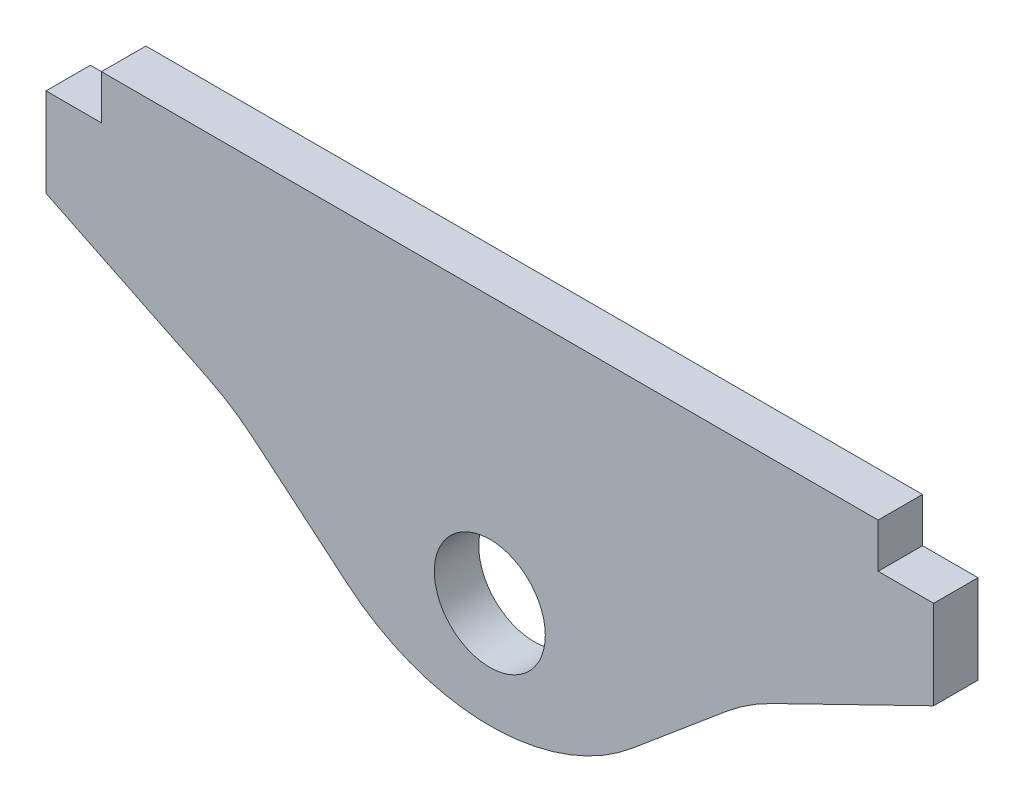
ISO-10303-21;
HEADER;
FILE_DESCRIPTION(('STEP AP214'),'2;1');
FILE_NAME('part.step','',(''),(''),'','','');
FILE_SCHEMA(('AUTOMOTIVE_DESIGN { 1 0 10303 214 1 1 1 1 }'));
ENDSEC;
DATA;
#1=APPLICATION_CONTEXT('core data for automotive mechanical design processes');
#2=APPLICATION_PROTOCOL_DEFINITION('international standard','automotive_design',2000,#1);
#3=PRODUCT_CONTEXT('',#1,'mechanical');
#4=PRODUCT('Part','Part','',(#3));
#5=PRODUCT_RELATED_PRODUCT_CATEGORY('part','',(#4));
#6=PRODUCT_DEFINITION_FORMATION('','',#4);
#7=PRODUCT_DEFINITION_CONTEXT('part definition',#1,'design');
#8=PRODUCT_DEFINITION('design','',#6,#7);
#9=PRODUCT_DEFINITION_SHAPE('','',#8);
#10=(LENGTH_UNIT() NAMED_UNIT(*) SI_UNIT(.MILLI.,.METRE.));
#11=(NAMED_UNIT(*) PLANE_ANGLE_UNIT() SI_UNIT($,.RADIAN.));
#12=(NAMED_UNIT(*) SI_UNIT($,.STERADIAN.) SOLID_ANGLE_UNIT());
#13=UNCERTAINTY_MEASURE_WITH_UNIT(LENGTH_MEASURE(1.E-05),#10,'distance_accuracy_value','');
#14=(GEOMETRIC_REPRESENTATION_CONTEXT(3) GLOBAL_UNCERTAINTY_ASSIGNED_CONTEXT((#13)) GLOBAL_UNIT_ASSIGNED_CONTEXT((#10,
#11,#12)) REPRESENTATION_CONTEXT('',''));
#15=CARTESIAN_POINT('',(0.,0.,0.));
#16=DIRECTION('',(0.,0.,1.));
#17=DIRECTION('',(1.,0.,0.));
#18=AXIS2_PLACEMENT_3D('',#15,#16,#17);
#19=CARTESIAN_POINT('',(-20.,0.,2.));
#20=DIRECTION('',(-1.,0.,0.));
#21=DIRECTION('',(0.,0.,1.));
#22=AXIS2_PLACEMENT_3D('',#19,#20,#21);
#23=PLANE('',#22);
#24=DIRECTION('',(0.,1.,0.));
#25=VECTOR('',#24,1.);
#26=CARTESIAN_POINT('',(-20.,0.,0.));
#27=LINE('',#26,#25);
#28=CARTESIAN_POINT('',(-20.,6.,0.));
#29=VERTEX_POINT('',#28);
#30=CARTESIAN_POINT('',(-20.,9.99999999999999,0.));
#31=VERTEX_POINT('',#30);
#32=EDGE_CURVE('E160',#29,#31,#27,.T.);
#33=ORIENTED_EDGE('',*,*,#32,.F.);
#34=DIRECTION('',(0.,0.,-1.));
#35=VECTOR('',#34,1.);
#36=CARTESIAN_POINT('',(-20.,6.,2.));
#37=LINE('',#36,#35);
#38=CARTESIAN_POINT('',(-20.,6.,2.));
#39=VERTEX_POINT('',#38);
#40=EDGE_CURVE('E146',#39,#29,#37,.T.);
#41=ORIENTED_EDGE('',*,*,#40,.F.);
#42=DIRECTION('',(0.,1.,0.));
#43=VECTOR('',#42,1.);
#44=CARTESIAN_POINT('',(-20.,0.,2.));
#45=LINE('',#44,#43);
#46=CARTESIAN_POINT('',(-20.,9.99999999999999,2.));
#47=VERTEX_POINT('',#46);
#48=EDGE_CURVE('E154',#39,#47,#45,.T.);
#49=ORIENTED_EDGE('',*,*,#48,.T.);
#50=DIRECTION('',(0.,0.,-1.));
#51=VECTOR('',#50,1.);
#52=CARTESIAN_POINT('',(-20.,9.99999999999999,2.));
#53=LINE('',#52,#51);
#54=EDGE_CURVE('E210',#47,#31,#53,.T.);
#55=ORIENTED_EDGE('',*,*,#54,.T.);
#56=EDGE_LOOP('',(#33,#41,#49,#55));
#57=FACE_BOUND('',#56,.T.);
#58=ADVANCED_FACE('F39',(#57),#23,.T.);
#59=CARTESIAN_POINT('',(-1.47935298592318,-3.03312311009014,2.));
#60=DIRECTION('',(-0.438371146789072,-0.89879404629917,0.));
#61=DIRECTION('',(0.89879404629917,-0.438371146789072,0.));
#62=AXIS2_PLACEMENT_3D('',#59,#60,#61);
#63=PLANE('',#62);
#64=DIRECTION('',(-0.89879404629917,0.438371146789072,0.));
#65=VECTOR('',#64,1.);
#66=CARTESIAN_POINT('',(-1.47935298592318,-3.03312311009014,0.));
#67=LINE('',#66,#65);
#68=CARTESIAN_POINT('',(-12.7090853084118,2.44398330445888,0.));
#69=VERTEX_POINT('',#68);
#70=EDGE_CURVE('E213',#69,#29,#67,.T.);
#71=ORIENTED_EDGE('',*,*,#70,.F.);
#72=DIRECTION('',(0.,0.,-1.));
#73=VECTOR('',#72,1.);
#74=CARTESIAN_POINT('',(-12.7090853084118,2.44398330445888,2.));
#75=LINE('',#74,#73);
#76=CARTESIAN_POINT('',(-12.7090853084118,2.44398330445888,2.));
#77=VERTEX_POINT('',#76);
#78=EDGE_CURVE('E149',#69,#77,#75,.F.);
#79=ORIENTED_EDGE('',*,*,#78,.T.);
#80=DIRECTION('',(-0.89879404629917,0.438371146789072,0.));
#81=VECTOR('',#80,1.);
#82=CARTESIAN_POINT('',(-1.47935298592318,-3.03312311009014,2.));
#83=LINE('',#82,#81);
#84=EDGE_CURVE('E142',#77,#39,#83,.T.);
#85=ORIENTED_EDGE('',*,*,#84,.T.);
#86=ORIENTED_EDGE('',*,*,#40,.T.);
#87=EDGE_LOOP('',(#71,#79,#85,#86));
#88=FACE_BOUND('',#87,.T.);
#89=ADVANCED_FACE('F145',(#88),#63,.T.);
#90=CARTESIAN_POINT('',(-3.85672565811923,-4.59626665871388,2.));
#91=DIRECTION('',(-0.642787609686538,-0.766044443118979,0.));
#92=DIRECTION('',(0.766044443118979,-0.642787609686538,0.));
#93=AXIS2_PLACEMENT_3D('',#90,#91,#92);
#94=PLANE('',#93);
#95=DIRECTION('',(-0.766044443118979,0.642787609686538,0.));
#96=VECTOR('',#95,1.);
#97=CARTESIAN_POINT('',(-3.85672565811923,-4.59626665871388,2.));
#98=LINE('',#97,#96);
#99=CARTESIAN_POINT('',(-6.42787609686538,-2.43881527386069,2.));
#100=VERTEX_POINT('',#99);
#101=CARTESIAN_POINT('',(-10.6649206794372,1.11648727265698,2.));
#102=VERTEX_POINT('',#101);
#103=EDGE_CURVE('E153',#100,#102,#98,.T.);
#104=ORIENTED_EDGE('',*,*,#103,.T.);
#105=DIRECTION('',(0.,0.,-1.));
#106=VECTOR('',#105,1.);
#107=CARTESIAN_POINT('',(-10.6649206794372,1.11648727265698,0.));
#108=LINE('',#107,#106);
#109=CARTESIAN_POINT('',(-10.6649206794372,1.11648727265698,0.));
#110=VERTEX_POINT('',#109);
#111=EDGE_CURVE('E271',#102,#110,#108,.T.);
#112=ORIENTED_EDGE('',*,*,#111,.T.);
#113=DIRECTION('',(-0.766044443118979,0.642787609686538,0.));
#114=VECTOR('',#113,1.);
#115=CARTESIAN_POINT('',(-3.85672565811923,-4.59626665871388,0.));
#116=LINE('',#115,#114);
#117=CARTESIAN_POINT('',(-6.42787609686538,-2.43881527386069,0.));
#118=VERTEX_POINT('',#117);
#119=EDGE_CURVE('E216',#118,#110,#116,.T.);
#120=ORIENTED_EDGE('',*,*,#119,.F.);
#121=DIRECTION('',(0.,0.,-1.));
#122=VECTOR('',#121,1.);
#123=CARTESIAN_POINT('',(-6.42787609686538,-2.43881527386069,2.));
#124=LINE('',#123,#122);
#125=EDGE_CURVE('E162',#118,#100,#124,.F.);
#126=ORIENTED_EDGE('',*,*,#125,.T.);
#127=EDGE_LOOP('',(#104,#112,#120,#126));
#128=FACE_BOUND('',#127,.T.);
#129=ADVANCED_FACE('F342',(#128),#94,.T.);
#130=CARTESIAN_POINT('',(3.85672565811923,-4.59626665871388,2.));
#131=DIRECTION('',(-0.642787609686538,0.766044443118979,0.));
#132=DIRECTION('',(-0.766044443118979,-0.642787609686538,0.));
#133=AXIS2_PLACEMENT_3D('',#130,#131,#132);
#134=PLANE('',#133);
#135=DIRECTION('',(0.766044443118979,0.642787609686538,0.));
#136=VECTOR('',#135,1.);
#137=CARTESIAN_POINT('',(3.85672565811923,-4.59626665871388,0.));
#138=LINE('',#137,#136);
#139=CARTESIAN_POINT('',(6.42787609686538,-2.43881527386069,0.));
#140=VERTEX_POINT('',#139);
#141=CARTESIAN_POINT('',(10.6649206794372,1.11648727265698,0.));
#142=VERTEX_POINT('',#141);
#143=EDGE_CURVE('E220',#140,#142,#138,.T.);
#144=ORIENTED_EDGE('',*,*,#143,.T.);
#145=DIRECTION('',(0.,0.,-1.));
#146=VECTOR('',#145,1.);
#147=CARTESIAN_POINT('',(10.6649206794372,1.11648727265698,2.));
#148=LINE('',#147,#146);
#149=CARTESIAN_POINT('',(10.6649206794372,1.11648727265698,2.));
#150=VERTEX_POINT('',#149);
#151=EDGE_CURVE('E55',#142,#150,#148,.F.);
#152=ORIENTED_EDGE('',*,*,#151,.T.);
#153=DIRECTION('',(0.766044443118979,0.642787609686538,0.));
#154=VECTOR('',#153,1.);
#155=CARTESIAN_POINT('',(3.85672565811923,-4.59626665871388,2.));
#156=LINE('',#155,#154);
#157=CARTESIAN_POINT('',(6.42787609686538,-2.43881527386069,2.));
#158=VERTEX_POINT('',#157);
#159=EDGE_CURVE('E181',#158,#150,#156,.T.);
#160=ORIENTED_EDGE('',*,*,#159,.F.);
#161=DIRECTION('',(0.,0.,-1.));
#162=VECTOR('',#161,1.);
#163=CARTESIAN_POINT('',(6.42787609686538,-2.43881527386069,0.));
#164=LINE('',#163,#162);
#165=EDGE_CURVE('E281',#158,#140,#164,.T.);
#166=ORIENTED_EDGE('',*,*,#165,.T.);
#167=EDGE_LOOP('',(#144,#152,#160,#166));
#168=FACE_BOUND('',#167,.T.);
#169=ADVANCED_FACE('F306',(#168),#134,.F.);
#170=CARTESIAN_POINT('',(1.47935298592318,-3.03312311009014,2.));
#171=DIRECTION('',(-0.438371146789072,0.89879404629917,0.));
#172=DIRECTION('',(-0.89879404629917,-0.438371146789072,0.));
#173=AXIS2_PLACEMENT_3D('',#170,#171,#172);
#174=PLANE('',#173);
#175=DIRECTION('',(0.89879404629917,0.438371146789072,0.));
#176=VECTOR('',#175,1.);
#177=CARTESIAN_POINT('',(1.47935298592318,-3.03312311009014,2.));
#178=LINE('',#177,#176);
#179=CARTESIAN_POINT('',(12.7090853084118,2.44398330445889,2.));
#180=VERTEX_POINT('',#179);
#181=CARTESIAN_POINT('',(20.,6.,2.));
#182=VERTEX_POINT('',#181);
#183=EDGE_CURVE('E184',#180,#182,#178,.T.);
#184=ORIENTED_EDGE('',*,*,#183,.F.);
#185=DIRECTION('',(0.,0.,-1.));
#186=VECTOR('',#185,1.);
#187=CARTESIAN_POINT('',(12.7090853084118,2.44398330445889,0.));
#188=LINE('',#187,#186);
#189=CARTESIAN_POINT('',(12.7090853084118,2.44398330445889,0.));
#190=VERTEX_POINT('',#189);
#191=EDGE_CURVE('E277',#180,#190,#188,.T.);
#192=ORIENTED_EDGE('',*,*,#191,.T.);
#193=DIRECTION('',(0.89879404629917,0.438371146789072,0.));
#194=VECTOR('',#193,1.);
#195=CARTESIAN_POINT('',(1.47935298592318,-3.03312311009014,0.));
#196=LINE('',#195,#194);
#197=CARTESIAN_POINT('',(20.,6.,0.));
#198=VERTEX_POINT('',#197);
#199=EDGE_CURVE('E223',#190,#198,#196,.T.);
#200=ORIENTED_EDGE('',*,*,#199,.T.);
#201=DIRECTION('',(0.,0.,-1.));
#202=VECTOR('',#201,1.);
#203=CARTESIAN_POINT('',(20.,6.,2.));
#204=LINE('',#203,#202);
#205=EDGE_CURVE('E163',#182,#198,#204,.T.);
#206=ORIENTED_EDGE('',*,*,#205,.F.);
#207=EDGE_LOOP('',(#184,#192,#200,#206));
#208=FACE_BOUND('',#207,.T.);
#209=ADVANCED_FACE('F313',(#208),#174,.F.);
#210=CARTESIAN_POINT('',(20.,0.,2.));
#211=DIRECTION('',(-1.,0.,0.));
#212=DIRECTION('',(0.,0.,1.));
#213=AXIS2_PLACEMENT_3D('',#210,#211,#212);
#214=PLANE('',#213);
#215=DIRECTION('',(0.,1.,0.));
#216=VECTOR('',#215,1.);
#217=CARTESIAN_POINT('',(20.,0.,0.));
#218=LINE('',#217,#216);
#219=CARTESIAN_POINT('',(20.,9.99999999999999,0.));
#220=VERTEX_POINT('',#219);
#221=EDGE_CURVE('E226',#198,#220,#218,.T.);
#222=ORIENTED_EDGE('',*,*,#221,.T.);
#223=DIRECTION('',(0.,0.,-1.));
#224=VECTOR('',#223,1.);
#225=CARTESIAN_POINT('',(20.,9.99999999999999,2.));
#226=LINE('',#225,#224);
#227=CARTESIAN_POINT('',(20.,9.99999999999999,2.));
#228=VERTEX_POINT('',#227);
#229=EDGE_CURVE('E262',#228,#220,#226,.T.);
#230=ORIENTED_EDGE('',*,*,#229,.F.);
#231=DIRECTION('',(0.,1.,0.));
#232=VECTOR('',#231,1.);
#233=CARTESIAN_POINT('',(20.,0.,2.));
#234=LINE('',#233,#232);
#235=EDGE_CURVE('E187',#182,#228,#234,.T.);
#236=ORIENTED_EDGE('',*,*,#235,.F.);
#237=ORIENTED_EDGE('',*,*,#205,.T.);
#238=EDGE_LOOP('',(#222,#230,#236,#237));
#239=FACE_BOUND('',#238,.T.);
#240=ADVANCED_FACE('F317',(#239),#214,.F.);
#241=CARTESIAN_POINT('',(0.,9.99999999999999,2.));
#242=DIRECTION('',(0.,-1.,0.));
#243=DIRECTION('',(0.,0.,-1.));
#244=AXIS2_PLACEMENT_3D('',#241,#242,#243);
#245=PLANE('',#244);
#246=DIRECTION('',(-1.,0.,0.));
#247=VECTOR('',#246,1.);
#248=CARTESIAN_POINT('',(0.,9.99999999999999,0.));
#249=LINE('',#248,#247);
#250=CARTESIAN_POINT('',(17.5,9.99999999999999,0.));
#251=VERTEX_POINT('',#250);
#252=EDGE_CURVE('E229',#220,#251,#249,.T.);
#253=ORIENTED_EDGE('',*,*,#252,.T.);
#254=DIRECTION('',(0.,0.,-1.));
#255=VECTOR('',#254,1.);
#256=CARTESIAN_POINT('',(17.5,9.99999999999999,2.));
#257=LINE('',#256,#255);
#258=CARTESIAN_POINT('',(17.5,9.99999999999999,2.));
#259=VERTEX_POINT('',#258);
#260=EDGE_CURVE('E258',#259,#251,#257,.T.);
#261=ORIENTED_EDGE('',*,*,#260,.F.);
#262=DIRECTION('',(-1.,0.,0.));
#263=VECTOR('',#262,1.);
#264=CARTESIAN_POINT('',(0.,9.99999999999999,2.));
#265=LINE('',#264,#263);
#266=EDGE_CURVE('E190',#228,#259,#265,.T.);
#267=ORIENTED_EDGE('',*,*,#266,.F.);
#268=ORIENTED_EDGE('',*,*,#229,.T.);
#269=EDGE_LOOP('',(#253,#261,#267,#268));
#270=FACE_BOUND('',#269,.T.);
#271=ADVANCED_FACE('F324',(#270),#245,.F.);
#272=CARTESIAN_POINT('',(17.5,0.,2.));
#273=DIRECTION('',(-1.,0.,0.));
#274=DIRECTION('',(0.,-1.,0.));
#275=AXIS2_PLACEMENT_3D('',#272,#273,#274);
#276=PLANE('',#275);
#277=DIRECTION('',(0.,1.,0.));
#278=VECTOR('',#277,1.);
#279=CARTESIAN_POINT('',(17.5,0.,0.));
#280=LINE('',#279,#278);
#281=CARTESIAN_POINT('',(17.5,12.,0.));
#282=VERTEX_POINT('',#281);
#283=EDGE_CURVE('E232',#251,#282,#280,.T.);
#284=ORIENTED_EDGE('',*,*,#283,.T.);
#285=DIRECTION('',(0.,0.,-1.));
#286=VECTOR('',#285,1.);
#287=CARTESIAN_POINT('',(17.5,12.,2.));
#288=LINE('',#287,#286);
#289=CARTESIAN_POINT('',(17.5,12.,2.));
#290=VERTEX_POINT('',#289);
#291=EDGE_CURVE('E255',#290,#282,#288,.T.);
#292=ORIENTED_EDGE('',*,*,#291,.F.);
#293=DIRECTION('',(0.,1.,0.));
#294=VECTOR('',#293,1.);
#295=CARTESIAN_POINT('',(17.5,0.,2.));
#296=LINE('',#295,#294);
#297=EDGE_CURVE('E193',#259,#290,#296,.T.);
#298=ORIENTED_EDGE('',*,*,#297,.F.);
#299=ORIENTED_EDGE('',*,*,#260,.T.);
#300=EDGE_LOOP('',(#284,#292,#298,#299));
#301=FACE_BOUND('',#300,.T.);
#302=ADVANCED_FACE('F328',(#301),#276,.F.);
#303=CARTESIAN_POINT('',(0.,12.,2.));
#304=DIRECTION('',(0.,1.,0.));
#305=DIRECTION('',(0.,0.,1.));
#306=AXIS2_PLACEMENT_3D('',#303,#304,#305);
#307=PLANE('',#306);
#308=DIRECTION('',(1.,0.,0.));
#309=VECTOR('',#308,1.);
#310=CARTESIAN_POINT('',(0.,12.,0.));
#311=LINE('',#310,#309);
#312=CARTESIAN_POINT('',(-17.5,12.,0.));
#313=VERTEX_POINT('',#312);
#314=EDGE_CURVE('E236',#313,#282,#311,.T.);
#315=ORIENTED_EDGE('',*,*,#314,.F.);
#316=DIRECTION('',(0.,0.,-1.));
#317=VECTOR('',#316,1.);
#318=CARTESIAN_POINT('',(-17.5,12.,2.));
#319=LINE('',#318,#317);
#320=CARTESIAN_POINT('',(-17.5,12.,2.));
#321=VERTEX_POINT('',#320);
#322=EDGE_CURVE('E252',#321,#313,#319,.T.);
#323=ORIENTED_EDGE('',*,*,#322,.F.);
#324=DIRECTION('',(1.,0.,0.));
#325=VECTOR('',#324,1.);
#326=CARTESIAN_POINT('',(0.,12.,2.));
#327=LINE('',#326,#325);
#328=EDGE_CURVE('E196',#321,#290,#327,.T.);
#329=ORIENTED_EDGE('',*,*,#328,.T.);
#330=ORIENTED_EDGE('',*,*,#291,.T.);
#331=EDGE_LOOP('',(#315,#323,#329,#330));
#332=FACE_BOUND('',#331,.T.);
#333=ADVANCED_FACE('F331',(#332),#307,.T.);
#334=CARTESIAN_POINT('',(-17.5,0.,2.));
#335=DIRECTION('',(-1.,0.,0.));
#336=DIRECTION('',(0.,-1.,0.));
#337=AXIS2_PLACEMENT_3D('',#334,#335,#336);
#338=PLANE('',#337);
#339=DIRECTION('',(0.,1.,0.));
#340=VECTOR('',#339,1.);
#341=CARTESIAN_POINT('',(-17.5,0.,0.));
#342=LINE('',#341,#340);
#343=CARTESIAN_POINT('',(-17.5,9.99999999999999,0.));
#344=VERTEX_POINT('',#343);
#345=EDGE_CURVE('E240',#344,#313,#342,.T.);
#346=ORIENTED_EDGE('',*,*,#345,.F.);
#347=DIRECTION('',(0.,0.,-1.));
#348=VECTOR('',#347,1.);
#349=CARTESIAN_POINT('',(-17.5,9.99999999999999,2.));
#350=LINE('',#349,#348);
#351=CARTESIAN_POINT('',(-17.5,9.99999999999999,2.));
#352=VERTEX_POINT('',#351);
#353=EDGE_CURVE('E249',#352,#344,#350,.T.);
#354=ORIENTED_EDGE('',*,*,#353,.F.);
#355=DIRECTION('',(0.,1.,0.));
#356=VECTOR('',#355,1.);
#357=CARTESIAN_POINT('',(-17.5,0.,2.));
#358=LINE('',#357,#356);
#359=EDGE_CURVE('E200',#352,#321,#358,.T.);
#360=ORIENTED_EDGE('',*,*,#359,.T.);
#361=ORIENTED_EDGE('',*,*,#322,.T.);
#362=EDGE_LOOP('',(#346,#354,#360,#361));
#363=FACE_BOUND('',#362,.T.);
#364=ADVANCED_FACE('F334',(#363),#338,.T.);
#365=CARTESIAN_POINT('',(0.,9.99999999999999,2.));
#366=DIRECTION('',(0.,1.,0.));
#367=DIRECTION('',(0.,0.,1.));
#368=AXIS2_PLACEMENT_3D('',#365,#366,#367);
#369=PLANE('',#368);
#370=DIRECTION('',(1.,0.,0.));
#371=VECTOR('',#370,1.);
#372=CARTESIAN_POINT('',(0.,9.99999999999999,0.));
#373=LINE('',#372,#371);
#374=EDGE_CURVE('E175',#31,#344,#373,.T.);
#375=ORIENTED_EDGE('',*,*,#374,.F.);
#376=ORIENTED_EDGE('',*,*,#54,.F.);
#377=DIRECTION('',(1.,0.,0.));
#378=VECTOR('',#377,1.);
#379=CARTESIAN_POINT('',(0.,9.99999999999999,2.));
#380=LINE('',#379,#378);
#381=EDGE_CURVE('E169',#47,#352,#380,.T.);
#382=ORIENTED_EDGE('',*,*,#381,.T.);
#383=ORIENTED_EDGE('',*,*,#353,.T.);
#384=EDGE_LOOP('',(#375,#376,#382,#383));
#385=FACE_BOUND('',#384,.T.);
#386=ADVANCED_FACE('F337',(#385),#369,.T.);
#387=CARTESIAN_POINT('',(0.,0.,2.));
#388=DIRECTION('',(0.,0.,-1.));
#389=DIRECTION('',(-1.,0.,0.));
#390=AXIS2_PLACEMENT_3D('',#387,#388,#389);
#391=CYLINDRICAL_SURFACE('',#390,2.5);
#392=CARTESIAN_POINT('',(0.,0.,2.));
#393=DIRECTION('',(0.,0.,1.));
#394=DIRECTION('',(1.,0.,0.));
#395=AXIS2_PLACEMENT_3D('',#392,#393,#394);
#396=CIRCLE('',#395,2.5);
#397=CARTESIAN_POINT('',(2.5,0.,2.));
#398=VERTEX_POINT('',#397);
#399=EDGE_CURVE('E206',#398,#398,#396,.T.);
#400=ORIENTED_EDGE('',*,*,#399,.T.);
#401=EDGE_LOOP('',(#400));
#402=FACE_BOUND('',#401,.T.);
#403=CARTESIAN_POINT('',(0.,0.,0.));
#404=DIRECTION('',(0.,0.,1.));
#405=DIRECTION('',(1.,0.,0.));
#406=AXIS2_PLACEMENT_3D('',#403,#404,#405);
#407=CIRCLE('',#406,2.5);
#408=CARTESIAN_POINT('',(2.5,0.,0.));
#409=VERTEX_POINT('',#408);
#410=EDGE_CURVE('E171',#409,#409,#407,.T.);
#411=ORIENTED_EDGE('',*,*,#410,.F.);
#412=EDGE_LOOP('',(#411));
#413=FACE_BOUND('',#412,.T.);
#414=ADVANCED_FACE('F366',(#402,#413),#391,.F.);
#415=CARTESIAN_POINT('',(0.,0.,2.));
#416=DIRECTION('',(0.,0.,1.));
#417=DIRECTION('',(1.,0.,0.));
#418=AXIS2_PLACEMENT_3D('',#415,#416,#417);
#419=PLANE('',#418);
#420=ORIENTED_EDGE('',*,*,#103,.F.);
#421=CARTESIAN_POINT('',(0.,5.22162915732911,2.));
#422=DIRECTION('',(0.,0.,1.));
#423=DIRECTION('',(1.,0.,0.));
#424=AXIS2_PLACEMENT_3D('',#421,#422,#423);
#425=CIRCLE('',#424,10.);
#426=EDGE_CURVE('E62',#100,#158,#425,.T.);
#427=ORIENTED_EDGE('',*,*,#426,.T.);
#428=ORIENTED_EDGE('',*,*,#159,.T.);
#429=CARTESIAN_POINT('',(17.0927967763025,-6.54395715853281,2.));
#430=DIRECTION('',(0.,0.,1.));
#431=DIRECTION('',(1.,0.,0.));
#432=AXIS2_PLACEMENT_3D('',#429,#430,#431);
#433=CIRCLE('',#432,10.);
#434=EDGE_CURVE('E11',#150,#180,#433,.F.);
#435=ORIENTED_EDGE('',*,*,#434,.T.);
#436=ORIENTED_EDGE('',*,*,#183,.T.);
#437=ORIENTED_EDGE('',*,*,#235,.T.);
#438=ORIENTED_EDGE('',*,*,#266,.T.);
#439=ORIENTED_EDGE('',*,*,#297,.T.);
#440=ORIENTED_EDGE('',*,*,#328,.F.);
#441=ORIENTED_EDGE('',*,*,#359,.F.);
#442=ORIENTED_EDGE('',*,*,#381,.F.);
#443=ORIENTED_EDGE('',*,*,#48,.F.);
#444=ORIENTED_EDGE('',*,*,#84,.F.);
#445=CARTESIAN_POINT('',(-17.0927967763025,-6.54395715853281,2.));
#446=DIRECTION('',(0.,0.,1.));
#447=DIRECTION('',(1.,0.,0.));
#448=AXIS2_PLACEMENT_3D('',#445,#446,#447);
#449=CIRCLE('',#448,10.);
#450=EDGE_CURVE('E295',#77,#102,#449,.F.);
#451=ORIENTED_EDGE('',*,*,#450,.T.);
#452=EDGE_LOOP('',(#420,#427,#428,#435,#436,#437,#438,#439,#440,#441,#442,#443,#444,#451));
#453=FACE_BOUND('',#452,.T.);
#454=ORIENTED_EDGE('',*,*,#399,.F.);
#455=EDGE_LOOP('',(#454));
#456=FACE_BOUND('',#455,.T.);
#457=ADVANCED_FACE('F165',(#453,#456),#419,.T.);
#458=CARTESIAN_POINT('',(0.,0.,0.));
#459=DIRECTION('',(0.,0.,1.));
#460=DIRECTION('',(1.,0.,0.));
#461=AXIS2_PLACEMENT_3D('',#458,#459,#460);
#462=PLANE('',#461);
#463=ORIENTED_EDGE('',*,*,#143,.F.);
#464=CARTESIAN_POINT('',(0.,5.22162915732911,0.));
#465=DIRECTION('',(0.,0.,1.));
#466=DIRECTION('',(1.,0.,0.));
#467=AXIS2_PLACEMENT_3D('',#464,#465,#466);
#468=CIRCLE('',#467,10.);
#469=EDGE_CURVE('E287',#140,#118,#468,.F.);
#470=ORIENTED_EDGE('',*,*,#469,.T.);
#471=ORIENTED_EDGE('',*,*,#119,.T.);
#472=CARTESIAN_POINT('',(-17.0927967763025,-6.54395715853281,0.));
#473=DIRECTION('',(0.,0.,1.));
#474=DIRECTION('',(1.,0.,0.));
#475=AXIS2_PLACEMENT_3D('',#472,#473,#474);
#476=CIRCLE('',#475,10.);
#477=EDGE_CURVE('E292',#110,#69,#476,.T.);
#478=ORIENTED_EDGE('',*,*,#477,.T.);
#479=ORIENTED_EDGE('',*,*,#70,.T.);
#480=ORIENTED_EDGE('',*,*,#32,.T.);
#481=ORIENTED_EDGE('',*,*,#374,.T.);
#482=ORIENTED_EDGE('',*,*,#345,.T.);
#483=ORIENTED_EDGE('',*,*,#314,.T.);
#484=ORIENTED_EDGE('',*,*,#283,.F.);
#485=ORIENTED_EDGE('',*,*,#252,.F.);
#486=ORIENTED_EDGE('',*,*,#221,.F.);
#487=ORIENTED_EDGE('',*,*,#199,.F.);
#488=CARTESIAN_POINT('',(17.0927967763025,-6.54395715853281,0.));
#489=DIRECTION('',(0.,0.,1.));
#490=DIRECTION('',(1.,0.,0.));
#491=AXIS2_PLACEMENT_3D('',#488,#489,#490);
#492=CIRCLE('',#491,10.);
#493=EDGE_CURVE('E48',#190,#142,#492,.T.);
#494=ORIENTED_EDGE('',*,*,#493,.T.);
#495=EDGE_LOOP('',(#463,#470,#471,#478,#479,#480,#481,#482,#483,#484,#485,#486,#487,#494));
#496=FACE_BOUND('',#495,.T.);
#497=ORIENTED_EDGE('',*,*,#410,.T.);
#498=EDGE_LOOP('',(#497));
#499=FACE_BOUND('',#498,.T.);
#500=ADVANCED_FACE('F301',(#496,#499),#462,.F.);
#501=CARTESIAN_POINT('',(-17.0927967763025,-6.54395715853281,2.));
#502=DIRECTION('',(0.,0.,1.));
#503=DIRECTION('',(1.,0.,0.));
#504=AXIS2_PLACEMENT_3D('',#501,#502,#503);
#505=CYLINDRICAL_SURFACE('',#504,10.);
#506=ORIENTED_EDGE('',*,*,#450,.F.);
#507=ORIENTED_EDGE('',*,*,#78,.F.);
#508=ORIENTED_EDGE('',*,*,#477,.F.);
#509=ORIENTED_EDGE('',*,*,#111,.F.);
#510=EDGE_LOOP('',(#506,#507,#508,#509));
#511=FACE_BOUND('',#510,.T.);
#512=ADVANCED_FACE('F339',(#511),#505,.F.);
#513=CARTESIAN_POINT('',(17.0927967763025,-6.54395715853281,2.));
#514=DIRECTION('',(0.,0.,1.));
#515=DIRECTION('',(1.,0.,0.));
#516=AXIS2_PLACEMENT_3D('',#513,#514,#515);
#517=CYLINDRICAL_SURFACE('',#516,10.);
#518=ORIENTED_EDGE('',*,*,#434,.F.);
#519=ORIENTED_EDGE('',*,*,#151,.F.);
#520=ORIENTED_EDGE('',*,*,#493,.F.);
#521=ORIENTED_EDGE('',*,*,#191,.F.);
#522=EDGE_LOOP('',(#518,#519,#520,#521));
#523=FACE_BOUND('',#522,.T.);
#524=ADVANCED_FACE('F309',(#523),#517,.F.);
#525=CARTESIAN_POINT('',(0.,5.22162915732911,2.));
#526=DIRECTION('',(0.,0.,1.));
#527=DIRECTION('',(1.,0.,0.));
#528=AXIS2_PLACEMENT_3D('',#525,#526,#527);
#529=CYLINDRICAL_SURFACE('',#528,10.);
#530=ORIENTED_EDGE('',*,*,#426,.F.);
#531=ORIENTED_EDGE('',*,*,#125,.F.);
#532=ORIENTED_EDGE('',*,*,#469,.F.);
#533=ORIENTED_EDGE('',*,*,#165,.F.);
#534=EDGE_LOOP('',(#530,#531,#532,#533));
#535=FACE_BOUND('',#534,.T.);
#536=ADVANCED_FACE('F41',(#535),#529,.T.);
#537=CLOSED_SHELL('',(#58,#89,#129,#169,#209,#240,#271,#302,#333,#364,#386,#414,#457,#500,#512,
#524,#536));
#538=MANIFOLD_SOLID_BREP('B2',#537);
#539=ADVANCED_BREP_SHAPE_REPRESENTATION('',(#18,#538),#14);
#540=SHAPE_DEFINITION_REPRESENTATION(#9,#539);
ENDSEC;
END-ISO-10303-21;
